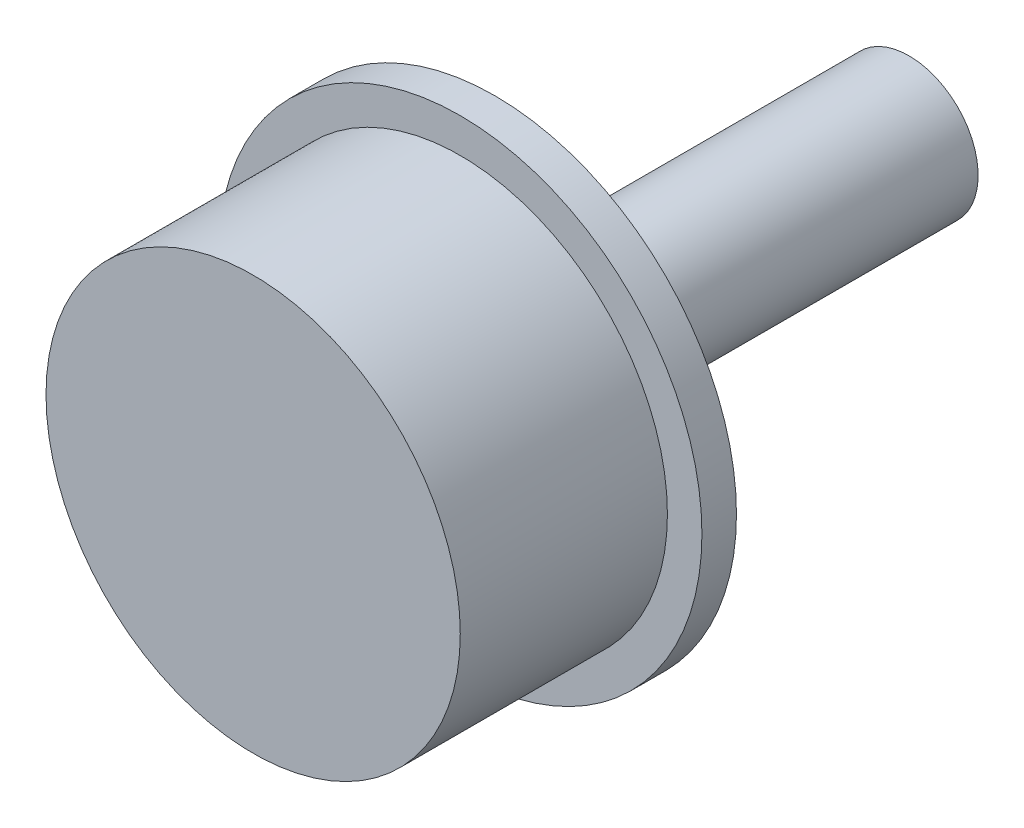
ISO-10303-21;
HEADER;
FILE_DESCRIPTION(('STEP AP214'),'2;1');
FILE_NAME('part.step','',(''),(''),'','','');
FILE_SCHEMA(('AUTOMOTIVE_DESIGN { 1 0 10303 214 1 1 1 1 }'));
ENDSEC;
DATA;
#1=APPLICATION_CONTEXT('core data for automotive mechanical design processes');
#2=APPLICATION_PROTOCOL_DEFINITION('international standard','automotive_design',2000,#1);
#3=PRODUCT_CONTEXT('',#1,'mechanical');
#4=PRODUCT('Part','Part','',(#3));
#5=PRODUCT_RELATED_PRODUCT_CATEGORY('part','',(#4));
#6=PRODUCT_DEFINITION_FORMATION('','',#4);
#7=PRODUCT_DEFINITION_CONTEXT('part definition',#1,'design');
#8=PRODUCT_DEFINITION('design','',#6,#7);
#9=PRODUCT_DEFINITION_SHAPE('','',#8);
#10=(LENGTH_UNIT() NAMED_UNIT(*) SI_UNIT(.MILLI.,.METRE.));
#11=(NAMED_UNIT(*) PLANE_ANGLE_UNIT() SI_UNIT($,.RADIAN.));
#12=(NAMED_UNIT(*) SI_UNIT($,.STERADIAN.) SOLID_ANGLE_UNIT());
#13=UNCERTAINTY_MEASURE_WITH_UNIT(LENGTH_MEASURE(1.E-05),#10,'distance_accuracy_value','');
#14=(GEOMETRIC_REPRESENTATION_CONTEXT(3) GLOBAL_UNCERTAINTY_ASSIGNED_CONTEXT((#13)) GLOBAL_UNIT_ASSIGNED_CONTEXT((#10,
#11,#12)) REPRESENTATION_CONTEXT('',''));
#15=CARTESIAN_POINT('',(0.,0.,0.));
#16=DIRECTION('',(0.,0.,1.));
#17=DIRECTION('',(1.,0.,0.));
#18=AXIS2_PLACEMENT_3D('',#15,#16,#17);
#19=CARTESIAN_POINT('',(0.,3.,2.5));
#20=DIRECTION('',(0.,0.,-1.));
#21=DIRECTION('',(-1.,0.,0.));
#22=AXIS2_PLACEMENT_3D('',#19,#20,#21);
#23=PLANE('',#22);
#24=CARTESIAN_POINT('',(0.,0.,2.5));
#25=DIRECTION('',(0.,0.,1.));
#26=DIRECTION('',(1.,0.,0.));
#27=AXIS2_PLACEMENT_3D('',#24,#25,#26);
#28=CIRCLE('',#27,3.);
#29=CARTESIAN_POINT('',(3.,0.,2.5));
#30=VERTEX_POINT('',#29);
#31=EDGE_CURVE('E57',#30,#30,#28,.T.);
#32=ORIENTED_EDGE('',*,*,#31,.F.);
#33=EDGE_LOOP('',(#32));
#34=FACE_BOUND('',#33,.T.);
#35=CARTESIAN_POINT('',(0.,0.,2.5));
#36=DIRECTION('',(0.,0.,1.));
#37=DIRECTION('',(1.,0.,0.));
#38=AXIS2_PLACEMENT_3D('',#35,#36,#37);
#39=CIRCLE('',#38,3.5);
#40=CARTESIAN_POINT('',(3.5,0.,2.5));
#41=VERTEX_POINT('',#40);
#42=EDGE_CURVE('E47',#41,#41,#39,.T.);
#43=ORIENTED_EDGE('',*,*,#42,.T.);
#44=EDGE_LOOP('',(#43));
#45=FACE_BOUND('',#44,.T.);
#46=ADVANCED_FACE('F36',(#34,#45),#23,.F.);
#47=CARTESIAN_POINT('',(0.,0.,2.));
#48=DIRECTION('',(0.,0.,1.));
#49=DIRECTION('',(1.,0.,0.));
#50=AXIS2_PLACEMENT_3D('',#47,#48,#49);
#51=CYLINDRICAL_SURFACE('',#50,3.5);
#52=ORIENTED_EDGE('',*,*,#42,.F.);
#53=EDGE_LOOP('',(#52));
#54=FACE_BOUND('',#53,.T.);
#55=CARTESIAN_POINT('',(0.,0.,2.));
#56=DIRECTION('',(0.,0.,1.));
#57=DIRECTION('',(1.,0.,0.));
#58=AXIS2_PLACEMENT_3D('',#55,#56,#57);
#59=CIRCLE('',#58,3.5);
#60=CARTESIAN_POINT('',(3.5,0.,2.));
#61=VERTEX_POINT('',#60);
#62=EDGE_CURVE('E51',#61,#61,#59,.T.);
#63=ORIENTED_EDGE('',*,*,#62,.T.);
#64=EDGE_LOOP('',(#63));
#65=FACE_BOUND('',#64,.T.);
#66=ADVANCED_FACE('F65',(#54,#65),#51,.T.);
#67=CARTESIAN_POINT('',(0.,3.5,2.));
#68=DIRECTION('',(0.,0.,1.));
#69=DIRECTION('',(1.,0.,0.));
#70=AXIS2_PLACEMENT_3D('',#67,#68,#69);
#71=PLANE('',#70);
#72=CARTESIAN_POINT('',(0.,0.,2.));
#73=DIRECTION('',(0.,0.,1.));
#74=DIRECTION('',(1.,0.,0.));
#75=AXIS2_PLACEMENT_3D('',#72,#73,#74);
#76=CIRCLE('',#75,0.999999999999999);
#77=CARTESIAN_POINT('',(0.999999999999999,0.,2.));
#78=VERTEX_POINT('',#77);
#79=EDGE_CURVE('E40',#78,#78,#76,.F.);
#80=ORIENTED_EDGE('',*,*,#79,.F.);
#81=EDGE_LOOP('',(#80));
#82=FACE_BOUND('',#81,.T.);
#83=ORIENTED_EDGE('',*,*,#62,.F.);
#84=EDGE_LOOP('',(#83));
#85=FACE_BOUND('',#84,.T.);
#86=ADVANCED_FACE('F71',(#82,#85),#71,.F.);
#87=CARTESIAN_POINT('',(0.,3.,5.5));
#88=DIRECTION('',(0.,0.,-1.));
#89=DIRECTION('',(-1.,0.,0.));
#90=AXIS2_PLACEMENT_3D('',#87,#88,#89);
#91=PLANE('',#90);
#92=CARTESIAN_POINT('',(0.,0.,5.5));
#93=DIRECTION('',(0.,0.,1.));
#94=DIRECTION('',(1.,0.,0.));
#95=AXIS2_PLACEMENT_3D('',#92,#93,#94);
#96=CIRCLE('',#95,3.);
#97=CARTESIAN_POINT('',(3.,0.,5.5));
#98=VERTEX_POINT('',#97);
#99=EDGE_CURVE('E54',#98,#98,#96,.T.);
#100=ORIENTED_EDGE('',*,*,#99,.T.);
#101=EDGE_LOOP('',(#100));
#102=FACE_BOUND('',#101,.T.);
#103=ADVANCED_FACE('F76',(#102),#91,.F.);
#104=CARTESIAN_POINT('',(0.,0.,2.));
#105=DIRECTION('',(0.,0.,1.));
#106=DIRECTION('',(1.,0.,0.));
#107=AXIS2_PLACEMENT_3D('',#104,#105,#106);
#108=CYLINDRICAL_SURFACE('',#107,3.);
#109=ORIENTED_EDGE('',*,*,#99,.F.);
#110=EDGE_LOOP('',(#109));
#111=FACE_BOUND('',#110,.T.);
#112=ORIENTED_EDGE('',*,*,#31,.T.);
#113=EDGE_LOOP('',(#112));
#114=FACE_BOUND('',#113,.T.);
#115=ADVANCED_FACE('F61',(#111,#114),#108,.T.);
#116=CARTESIAN_POINT('',(0.,0.,0.));
#117=DIRECTION('',(0.,0.,-1.));
#118=DIRECTION('',(-1.,0.,0.));
#119=AXIS2_PLACEMENT_3D('',#116,#117,#118);
#120=CYLINDRICAL_SURFACE('',#119,0.999999999999999);
#121=CARTESIAN_POINT('',(0.,0.,-4.));
#122=DIRECTION('',(0.,0.,-1.));
#123=DIRECTION('',(-1.,0.,0.));
#124=AXIS2_PLACEMENT_3D('',#121,#122,#123);
#125=CIRCLE('',#124,0.999999999999999);
#126=CARTESIAN_POINT('',(-0.999999999999999,0.,-4.));
#127=VERTEX_POINT('',#126);
#128=EDGE_CURVE('E10',#127,#127,#125,.T.);
#129=ORIENTED_EDGE('',*,*,#128,.F.);
#130=EDGE_LOOP('',(#129));
#131=FACE_BOUND('',#130,.T.);
#132=ORIENTED_EDGE('',*,*,#79,.T.);
#133=EDGE_LOOP('',(#132));
#134=FACE_BOUND('',#133,.T.);
#135=ADVANCED_FACE('F86',(#131,#134),#120,.T.);
#136=CARTESIAN_POINT('',(0.,0.999999999999999,-4.));
#137=DIRECTION('',(0.,0.,-1.));
#138=DIRECTION('',(-1.,0.,0.));
#139=AXIS2_PLACEMENT_3D('',#136,#137,#138);
#140=PLANE('',#139);
#141=ORIENTED_EDGE('',*,*,#128,.T.);
#142=EDGE_LOOP('',(#141));
#143=FACE_BOUND('',#142,.T.);
#144=ADVANCED_FACE('F38',(#143),#140,.T.);
#145=CLOSED_SHELL('',(#46,#66,#86,#103,#115,#135,#144));
#146=MANIFOLD_SOLID_BREP('B2',#145);
#147=ADVANCED_BREP_SHAPE_REPRESENTATION('',(#18,#146),#14);
#148=SHAPE_DEFINITION_REPRESENTATION(#9,#147);
ENDSEC;
END-ISO-10303-21;
